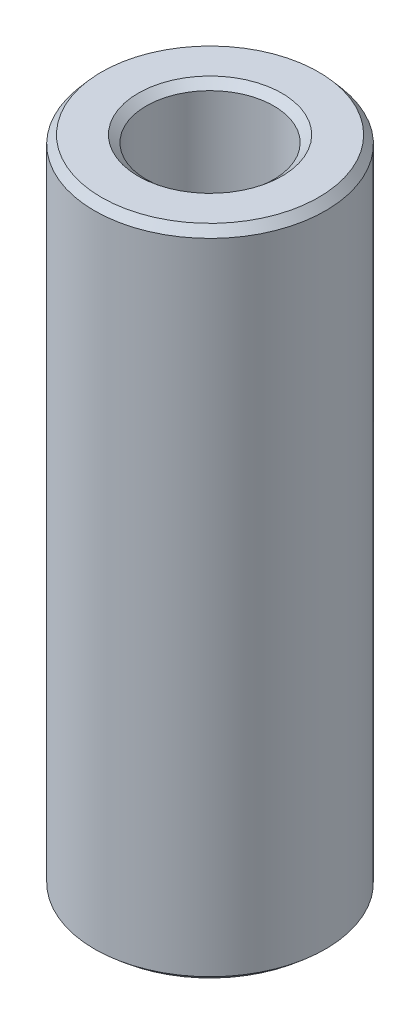
ISO-10303-21;
HEADER;
FILE_DESCRIPTION(('STEP AP214'),'2;1');
FILE_NAME('part.step','',(''),(''),'','','');
FILE_SCHEMA(('AUTOMOTIVE_DESIGN { 1 0 10303 214 1 1 1 1 }'));
ENDSEC;
DATA;
#1=APPLICATION_CONTEXT('core data for automotive mechanical design processes');
#2=APPLICATION_PROTOCOL_DEFINITION('international standard','automotive_design',2000,#1);
#3=PRODUCT_CONTEXT('',#1,'mechanical');
#4=PRODUCT('Part','Part','',(#3));
#5=PRODUCT_RELATED_PRODUCT_CATEGORY('part','',(#4));
#6=PRODUCT_DEFINITION_FORMATION('','',#4);
#7=PRODUCT_DEFINITION_CONTEXT('part definition',#1,'design');
#8=PRODUCT_DEFINITION('design','',#6,#7);
#9=PRODUCT_DEFINITION_SHAPE('','',#8);
#10=(LENGTH_UNIT() NAMED_UNIT(*) SI_UNIT(.MILLI.,.METRE.));
#11=(NAMED_UNIT(*) PLANE_ANGLE_UNIT() SI_UNIT($,.RADIAN.));
#12=(NAMED_UNIT(*) SI_UNIT($,.STERADIAN.) SOLID_ANGLE_UNIT());
#13=UNCERTAINTY_MEASURE_WITH_UNIT(LENGTH_MEASURE(1.E-05),#10,'distance_accuracy_value','');
#14=(GEOMETRIC_REPRESENTATION_CONTEXT(3) GLOBAL_UNCERTAINTY_ASSIGNED_CONTEXT((#13)) GLOBAL_UNIT_ASSIGNED_CONTEXT((#10,
#11,#12)) REPRESENTATION_CONTEXT('',''));
#15=CARTESIAN_POINT('',(0.,0.,0.));
#16=DIRECTION('',(0.,0.,1.));
#17=DIRECTION('',(1.,0.,0.));
#18=AXIS2_PLACEMENT_3D('',#15,#16,#17);
#19=CARTESIAN_POINT('',(0.,240.747035465362,0.));
#20=DIRECTION('',(0.,-1.,0.));
#21=DIRECTION('',(0.,0.,-1.));
#22=AXIS2_PLACEMENT_3D('',#19,#20,#21);
#23=CYLINDRICAL_SURFACE('',#22,42.5);
#24=CARTESIAN_POINT('',(0.,2.54265652920258,0.));
#25=DIRECTION('',(0.,1.,0.));
#26=DIRECTION('',(0.,0.,1.));
#27=AXIS2_PLACEMENT_3D('',#24,#25,#26);
#28=CIRCLE('',#27,42.5);
#29=CARTESIAN_POINT('',(0.,2.54265652920258,42.5));
#30=VERTEX_POINT('',#29);
#31=EDGE_CURVE('E10',#30,#30,#28,.T.);
#32=ORIENTED_EDGE('',*,*,#31,.T.);
#33=EDGE_LOOP('',(#32));
#34=FACE_BOUND('',#33,.T.);
#35=CARTESIAN_POINT('',(0.,237.749159314636,0.));
#36=DIRECTION('',(0.,1.,0.));
#37=DIRECTION('',(0.,0.,1.));
#38=AXIS2_PLACEMENT_3D('',#35,#36,#37);
#39=CIRCLE('',#38,42.5);
#40=CARTESIAN_POINT('',(0.,237.749159314636,42.5));
#41=VERTEX_POINT('',#40);
#42=EDGE_CURVE('E50',#41,#41,#39,.F.);
#43=ORIENTED_EDGE('',*,*,#42,.T.);
#44=EDGE_LOOP('',(#43));
#45=FACE_BOUND('',#44,.T.);
#46=ADVANCED_FACE('F39',(#34,#45),#23,.T.);
#47=CARTESIAN_POINT('',(0.,240.747035465362,0.));
#48=DIRECTION('',(0.,1.,0.));
#49=DIRECTION('',(0.,0.,1.));
#50=AXIS2_PLACEMENT_3D('',#47,#48,#49);
#51=PLANE('',#50);
#52=CARTESIAN_POINT('',(0.,240.747035465362,0.));
#53=DIRECTION('',(0.,1.,0.));
#54=DIRECTION('',(0.,0.,1.));
#55=AXIS2_PLACEMENT_3D('',#52,#53,#54);
#56=CIRCLE('',#55,26.445422458104);
#57=CARTESIAN_POINT('',(0.,240.747035465362,26.445422458104));
#58=VERTEX_POINT('',#57);
#59=EDGE_CURVE('E58',#58,#58,#56,.F.);
#60=ORIENTED_EDGE('',*,*,#59,.T.);
#61=EDGE_LOOP('',(#60));
#62=FACE_BOUND('',#61,.T.);
#63=CARTESIAN_POINT('',(0.,240.747035465362,0.));
#64=DIRECTION('',(0.,1.,0.));
#65=DIRECTION('',(0.,0.,1.));
#66=AXIS2_PLACEMENT_3D('',#63,#64,#65);
#67=CIRCLE('',#66,39.9573434707974);
#68=CARTESIAN_POINT('',(0.,240.747035465362,39.9573434707974));
#69=VERTEX_POINT('',#68);
#70=EDGE_CURVE('E61',#69,#69,#67,.T.);
#71=ORIENTED_EDGE('',*,*,#70,.T.);
#72=EDGE_LOOP('',(#71));
#73=FACE_BOUND('',#72,.T.);
#74=ADVANCED_FACE('F88',(#62,#73),#51,.T.);
#75=CARTESIAN_POINT('',(0.,0.,0.));
#76=DIRECTION('',(0.,1.,0.));
#77=DIRECTION('',(0.,0.,1.));
#78=AXIS2_PLACEMENT_3D('',#75,#76,#77);
#79=PLANE('',#78);
#80=CARTESIAN_POINT('',(0.,0.,0.));
#81=DIRECTION('',(0.,1.,0.));
#82=DIRECTION('',(0.,0.,1.));
#83=AXIS2_PLACEMENT_3D('',#80,#81,#82);
#84=CIRCLE('',#83,25.9902028365816);
#85=CARTESIAN_POINT('',(0.,0.,25.9902028365816));
#86=VERTEX_POINT('',#85);
#87=EDGE_CURVE('E51',#86,#86,#84,.T.);
#88=ORIENTED_EDGE('',*,*,#87,.T.);
#89=EDGE_LOOP('',(#88));
#90=FACE_BOUND('',#89,.T.);
#91=CARTESIAN_POINT('',(0.,0.,0.));
#92=DIRECTION('',(0.,1.,0.));
#93=DIRECTION('',(0.,0.,1.));
#94=AXIS2_PLACEMENT_3D('',#91,#92,#93);
#95=CIRCLE('',#94,39.5021238492749);
#96=CARTESIAN_POINT('',(0.,0.,39.5021238492749));
#97=VERTEX_POINT('',#96);
#98=EDGE_CURVE('E54',#97,#97,#95,.F.);
#99=ORIENTED_EDGE('',*,*,#98,.T.);
#100=EDGE_LOOP('',(#99));
#101=FACE_BOUND('',#100,.T.);
#102=ADVANCED_FACE('F83',(#90,#101),#79,.F.);
#103=CARTESIAN_POINT('',(0.,240.747035465362,0.));
#104=DIRECTION('',(0.,-1.,0.));
#105=DIRECTION('',(0.,0.,-1.));
#106=AXIS2_PLACEMENT_3D('',#103,#104,#105);
#107=CYLINDRICAL_SURFACE('',#106,23.447546307379);
#108=CARTESIAN_POINT('',(0.,238.204378936159,0.));
#109=DIRECTION('',(0.,1.,0.));
#110=DIRECTION('',(0.,0.,1.));
#111=AXIS2_PLACEMENT_3D('',#108,#109,#110);
#112=CIRCLE('',#111,23.447546307379);
#113=CARTESIAN_POINT('',(0.,238.204378936159,23.447546307379));
#114=VERTEX_POINT('',#113);
#115=EDGE_CURVE('E67',#114,#114,#112,.T.);
#116=ORIENTED_EDGE('',*,*,#115,.T.);
#117=EDGE_LOOP('',(#116));
#118=FACE_BOUND('',#117,.T.);
#119=CARTESIAN_POINT('',(0.,2.99787615072508,0.));
#120=DIRECTION('',(0.,1.,0.));
#121=DIRECTION('',(0.,0.,1.));
#122=AXIS2_PLACEMENT_3D('',#119,#120,#121);
#123=CIRCLE('',#122,23.447546307379);
#124=CARTESIAN_POINT('',(0.,2.99787615072508,23.447546307379));
#125=VERTEX_POINT('',#124);
#126=EDGE_CURVE('E69',#125,#125,#123,.F.);
#127=ORIENTED_EDGE('',*,*,#126,.T.);
#128=EDGE_LOOP('',(#127));
#129=FACE_BOUND('',#128,.T.);
#130=ADVANCED_FACE('F71',(#118,#129),#107,.F.);
#131=CARTESIAN_POINT('',(0.,238.204378936159,0.));
#132=DIRECTION('',(0.,1.,0.));
#133=DIRECTION('',(0.,0.,1.));
#134=AXIS2_PLACEMENT_3D('',#131,#132,#133);
#135=CONICAL_SURFACE('',#134,23.447546307379,0.867375736622384);
#136=ORIENTED_EDGE('',*,*,#59,.F.);
#137=EDGE_LOOP('',(#136));
#138=FACE_BOUND('',#137,.T.);
#139=ORIENTED_EDGE('',*,*,#115,.F.);
#140=EDGE_LOOP('',(#139));
#141=FACE_BOUND('',#140,.T.);
#142=ADVANCED_FACE('F77',(#138,#141),#135,.F.);
#143=CARTESIAN_POINT('',(0.,0.,0.));
#144=DIRECTION('',(0.,-1.,0.));
#145=DIRECTION('',(0.,0.,-1.));
#146=AXIS2_PLACEMENT_3D('',#143,#144,#145);
#147=CONICAL_SURFACE('',#146,25.9902028365816,0.703420590172507);
#148=ORIENTED_EDGE('',*,*,#126,.F.);
#149=EDGE_LOOP('',(#148));
#150=FACE_BOUND('',#149,.T.);
#151=ORIENTED_EDGE('',*,*,#87,.F.);
#152=EDGE_LOOP('',(#151));
#153=FACE_BOUND('',#152,.T.);
#154=ADVANCED_FACE('F73',(#150,#153),#147,.F.);
#155=CARTESIAN_POINT('',(0.,2.54265652920258,0.));
#156=DIRECTION('',(0.,1.,0.));
#157=DIRECTION('',(0.,0.,1.));
#158=AXIS2_PLACEMENT_3D('',#155,#156,#157);
#159=CONICAL_SURFACE('',#158,42.5,0.867375736622388);
#160=ORIENTED_EDGE('',*,*,#98,.F.);
#161=EDGE_LOOP('',(#160));
#162=FACE_BOUND('',#161,.T.);
#163=ORIENTED_EDGE('',*,*,#31,.F.);
#164=EDGE_LOOP('',(#163));
#165=FACE_BOUND('',#164,.T.);
#166=ADVANCED_FACE('F76',(#162,#165),#159,.T.);
#167=CARTESIAN_POINT('',(0.,240.747035465362,0.));
#168=DIRECTION('',(0.,-1.,0.));
#169=DIRECTION('',(0.,0.,-1.));
#170=AXIS2_PLACEMENT_3D('',#167,#168,#169);
#171=CONICAL_SURFACE('',#170,39.9573434707974,0.703420590172505);
#172=ORIENTED_EDGE('',*,*,#42,.F.);
#173=EDGE_LOOP('',(#172));
#174=FACE_BOUND('',#173,.T.);
#175=ORIENTED_EDGE('',*,*,#70,.F.);
#176=EDGE_LOOP('',(#175));
#177=FACE_BOUND('',#176,.T.);
#178=ADVANCED_FACE('F45',(#174,#177),#171,.T.);
#179=CLOSED_SHELL('',(#46,#74,#102,#130,#142,#154,#166,#178));
#180=MANIFOLD_SOLID_BREP('B2',#179);
#181=ADVANCED_BREP_SHAPE_REPRESENTATION('',(#18,#180),#14);
#182=SHAPE_DEFINITION_REPRESENTATION(#9,#181);
ENDSEC;
END-ISO-10303-21;
